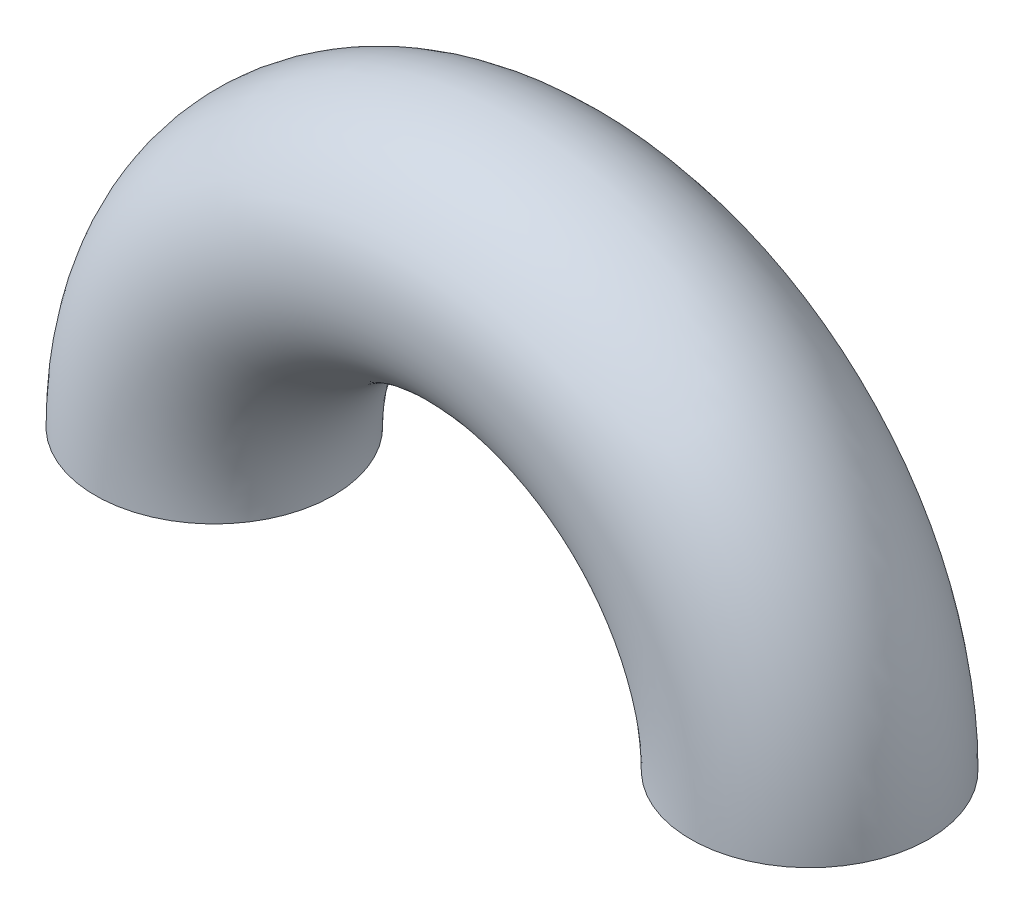
ISO-10303-21;
HEADER;
FILE_DESCRIPTION(('STEP AP214'),'2;1');
FILE_NAME('part.step','',(''),(''),'','','');
FILE_SCHEMA(('AUTOMOTIVE_DESIGN { 1 0 10303 214 1 1 1 1 }'));
ENDSEC;
DATA;
#1=APPLICATION_CONTEXT('core data for automotive mechanical design processes');
#2=APPLICATION_PROTOCOL_DEFINITION('international standard','automotive_design',2000,#1);
#3=PRODUCT_CONTEXT('',#1,'mechanical');
#4=PRODUCT('Part','Part','',(#3));
#5=PRODUCT_RELATED_PRODUCT_CATEGORY('part','',(#4));
#6=PRODUCT_DEFINITION_FORMATION('','',#4);
#7=PRODUCT_DEFINITION_CONTEXT('part definition',#1,'design');
#8=PRODUCT_DEFINITION('design','',#6,#7);
#9=PRODUCT_DEFINITION_SHAPE('','',#8);
#10=(LENGTH_UNIT() NAMED_UNIT(*) SI_UNIT(.MILLI.,.METRE.));
#11=(NAMED_UNIT(*) PLANE_ANGLE_UNIT() SI_UNIT($,.RADIAN.));
#12=(NAMED_UNIT(*) SI_UNIT($,.STERADIAN.) SOLID_ANGLE_UNIT());
#13=UNCERTAINTY_MEASURE_WITH_UNIT(LENGTH_MEASURE(1.E-05),#10,'distance_accuracy_value','');
#14=(GEOMETRIC_REPRESENTATION_CONTEXT(3) GLOBAL_UNCERTAINTY_ASSIGNED_CONTEXT((#13)) GLOBAL_UNIT_ASSIGNED_CONTEXT((#10,
#11,#12)) REPRESENTATION_CONTEXT('',''));
#15=CARTESIAN_POINT('',(0.,0.,0.));
#16=DIRECTION('',(0.,0.,1.));
#17=DIRECTION('',(1.,0.,0.));
#18=AXIS2_PLACEMENT_3D('',#15,#16,#17);
#19=CARTESIAN_POINT('',(0.,0.,0.));
#20=DIRECTION('',(0.,0.,1.));
#21=DIRECTION('',(1.,0.,0.));
#22=AXIS2_PLACEMENT_3D('',#19,#20,#21);
#23=TOROIDAL_SURFACE('',#22,12.5,5.);
#24=CARTESIAN_POINT('',(12.5,0.,0.));
#25=DIRECTION('',(0.,-1.,0.));
#26=DIRECTION('',(0.,0.,1.));
#27=AXIS2_PLACEMENT_3D('',#24,#25,#26);
#28=CIRCLE('',#27,5.);
#29=CARTESIAN_POINT('',(17.5,0.,0.));
#30=VERTEX_POINT('',#29);
#31=EDGE_CURVE('E10',#30,#30,#28,.T.);
#32=CARTESIAN_POINT('',(-12.5,0.,0.));
#33=DIRECTION('',(0.,1.,0.));
#34=DIRECTION('',(0.,0.,1.));
#35=AXIS2_PLACEMENT_3D('',#32,#33,#34);
#36=CIRCLE('',#35,5.);
#37=CARTESIAN_POINT('',(-17.5,0.,0.));
#38=VERTEX_POINT('',#37);
#39=EDGE_CURVE('E37',#38,#38,#36,.T.);
#40=CARTESIAN_POINT('',(0.,0.,0.));
#41=DIRECTION('',(0.,0.,1.));
#42=DIRECTION('',(1.,0.,0.));
#43=AXIS2_PLACEMENT_3D('',#40,#41,#42);
#44=CIRCLE('',#43,17.5);
#45=EDGE_CURVE('',#30,#38,#44,.T.);
#46=ORIENTED_EDGE('',*,*,#31,.F.);
#47=ORIENTED_EDGE('',*,*,#39,.T.);
#48=ORIENTED_EDGE('',*,*,#45,.T.);
#49=ORIENTED_EDGE('',*,*,#45,.F.);
#50=EDGE_LOOP('',(#46,#48,#47,#49));
#51=FACE_BOUND('',#50,.T.);
#52=ADVANCED_FACE('F31',(#51),#23,.T.);
#53=CARTESIAN_POINT('',(12.5,0.,0.));
#54=DIRECTION('',(0.,-1.,0.));
#55=DIRECTION('',(0.,0.,1.));
#56=AXIS2_PLACEMENT_3D('',#53,#54,#55);
#57=PLANE('',#56);
#58=CARTESIAN_POINT('',(12.5,0.,0.));
#59=DIRECTION('',(0.,-1.,0.));
#60=DIRECTION('',(1.,0.,0.));
#61=AXIS2_PLACEMENT_3D('',#58,#59,#60);
#62=CIRCLE('',#61,4.5);
#63=CARTESIAN_POINT('',(17.,0.,0.));
#64=VERTEX_POINT('',#63);
#65=EDGE_CURVE('E41',#64,#64,#62,.T.);
#66=ORIENTED_EDGE('',*,*,#65,.F.);
#67=EDGE_LOOP('',(#66));
#68=FACE_BOUND('',#67,.T.);
#69=ORIENTED_EDGE('',*,*,#31,.T.);
#70=EDGE_LOOP('',(#69));
#71=FACE_BOUND('',#70,.T.);
#72=ADVANCED_FACE('F61',(#68,#71),#57,.T.);
#73=CARTESIAN_POINT('',(-12.5,0.,0.));
#74=DIRECTION('',(0.,1.,0.));
#75=DIRECTION('',(0.,0.,1.));
#76=AXIS2_PLACEMENT_3D('',#73,#74,#75);
#77=PLANE('',#76);
#78=CARTESIAN_POINT('',(-12.5,0.,0.));
#79=DIRECTION('',(0.,1.,0.));
#80=DIRECTION('',(0.,0.,1.));
#81=AXIS2_PLACEMENT_3D('',#78,#79,#80);
#82=CIRCLE('',#81,4.5);
#83=CARTESIAN_POINT('',(-17.,0.,0.));
#84=VERTEX_POINT('',#83);
#85=EDGE_CURVE('E45',#84,#84,#82,.T.);
#86=ORIENTED_EDGE('',*,*,#85,.T.);
#87=EDGE_LOOP('',(#86));
#88=FACE_BOUND('',#87,.T.);
#89=ORIENTED_EDGE('',*,*,#39,.F.);
#90=EDGE_LOOP('',(#89));
#91=FACE_BOUND('',#90,.T.);
#92=ADVANCED_FACE('F51',(#88,#91),#77,.F.);
#93=CARTESIAN_POINT('',(0.,0.,0.));
#94=DIRECTION('',(0.,0.,1.));
#95=DIRECTION('',(1.,0.,0.));
#96=AXIS2_PLACEMENT_3D('',#93,#94,#95);
#97=TOROIDAL_SURFACE('',#96,12.5,4.5);
#98=CARTESIAN_POINT('',(0.,0.,0.));
#99=DIRECTION('',(0.,0.,1.));
#100=DIRECTION('',(1.,0.,0.));
#101=AXIS2_PLACEMENT_3D('',#98,#99,#100);
#102=CIRCLE('',#101,17.);
#103=EDGE_CURVE('',#64,#84,#102,.T.);
#104=ORIENTED_EDGE('',*,*,#65,.T.);
#105=ORIENTED_EDGE('',*,*,#85,.F.);
#106=ORIENTED_EDGE('',*,*,#103,.T.);
#107=ORIENTED_EDGE('',*,*,#103,.F.);
#108=EDGE_LOOP('',(#104,#106,#105,#107));
#109=FACE_BOUND('',#108,.T.);
#110=ADVANCED_FACE('F54',(#109),#97,.F.);
#111=CLOSED_SHELL('',(#52,#72,#92,#110));
#112=MANIFOLD_SOLID_BREP('B2',#111);
#113=ADVANCED_BREP_SHAPE_REPRESENTATION('',(#18,#112),#14);
#114=SHAPE_DEFINITION_REPRESENTATION(#9,#113);
ENDSEC;
END-ISO-10303-21;
